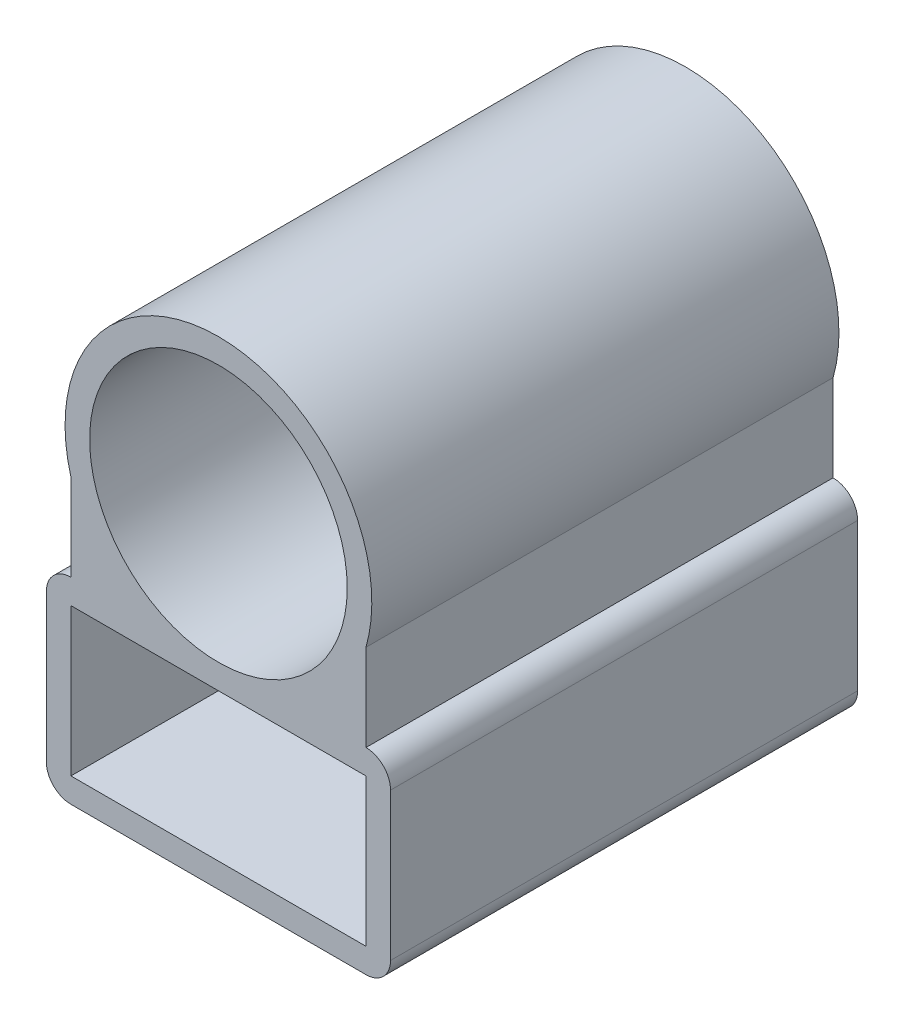
ISO-10303-21;
HEADER;
FILE_DESCRIPTION(('STEP AP214'),'2;1');
FILE_NAME('part.step','',(''),(''),'','','');
FILE_SCHEMA(('AUTOMOTIVE_DESIGN { 1 0 10303 214 1 1 1 1 }'));
ENDSEC;
DATA;
#1=APPLICATION_CONTEXT('core data for automotive mechanical design processes');
#2=APPLICATION_PROTOCOL_DEFINITION('international standard','automotive_design',2000,#1);
#3=PRODUCT_CONTEXT('',#1,'mechanical');
#4=PRODUCT('Part','Part','',(#3));
#5=PRODUCT_RELATED_PRODUCT_CATEGORY('part','',(#4));
#6=PRODUCT_DEFINITION_FORMATION('','',#4);
#7=PRODUCT_DEFINITION_CONTEXT('part definition',#1,'design');
#8=PRODUCT_DEFINITION('design','',#6,#7);
#9=PRODUCT_DEFINITION_SHAPE('','',#8);
#10=(LENGTH_UNIT() NAMED_UNIT(*) SI_UNIT(.MILLI.,.METRE.));
#11=(NAMED_UNIT(*) PLANE_ANGLE_UNIT() SI_UNIT($,.RADIAN.));
#12=(NAMED_UNIT(*) SI_UNIT($,.STERADIAN.) SOLID_ANGLE_UNIT());
#13=UNCERTAINTY_MEASURE_WITH_UNIT(LENGTH_MEASURE(1.E-05),#10,'distance_accuracy_value','');
#14=(GEOMETRIC_REPRESENTATION_CONTEXT(3) GLOBAL_UNCERTAINTY_ASSIGNED_CONTEXT((#13)) GLOBAL_UNIT_ASSIGNED_CONTEXT((#10,
#11,#12)) REPRESENTATION_CONTEXT('',''));
#15=CARTESIAN_POINT('',(0.,0.,0.));
#16=DIRECTION('',(0.,0.,1.));
#17=DIRECTION('',(1.,0.,0.));
#18=AXIS2_PLACEMENT_3D('',#15,#16,#17);
#19=CARTESIAN_POINT('',(60.,-62.3875,190.));
#20=DIRECTION('',(0.,0.,-1.));
#21=DIRECTION('',(-1.,0.,0.));
#22=AXIS2_PLACEMENT_3D('',#19,#20,#21);
#23=PLANE('',#22);
#24=CARTESIAN_POINT('',(0.,0.,190.));
#25=DIRECTION('',(0.,0.,1.));
#26=DIRECTION('',(1.,0.,0.));
#27=AXIS2_PLACEMENT_3D('',#24,#25,#26);
#28=CIRCLE('',#27,52.3875);
#29=CARTESIAN_POINT('',(52.3875,0.,190.));
#30=VERTEX_POINT('',#29);
#31=EDGE_CURVE('E176',#30,#30,#28,.T.);
#32=ORIENTED_EDGE('',*,*,#31,.F.);
#33=EDGE_LOOP('',(#32));
#34=FACE_BOUND('',#33,.T.);
#35=CARTESIAN_POINT('',(60.,-62.3875,190.));
#36=DIRECTION('',(0.,0.,1.));
#37=DIRECTION('',(-1.,0.,0.));
#38=AXIS2_PLACEMENT_3D('',#35,#36,#37);
#39=CIRCLE('',#38,9.99999999999999);
#40=CARTESIAN_POINT('',(70.,-62.3875,190.));
#41=VERTEX_POINT('',#40);
#42=CARTESIAN_POINT('',(60.,-52.3875,190.));
#43=VERTEX_POINT('',#42);
#44=EDGE_CURVE('E182',#41,#43,#39,.T.);
#45=ORIENTED_EDGE('',*,*,#44,.T.);
#46=DIRECTION('',(0.,1.,0.));
#47=VECTOR('',#46,1.);
#48=CARTESIAN_POINT('',(60.,-52.3875,190.));
#49=LINE('',#48,#47);
#50=CARTESIAN_POINT('',(60.,-17.0938631166275,190.));
#51=VERTEX_POINT('',#50);
#52=EDGE_CURVE('E185',#43,#51,#49,.T.);
#53=ORIENTED_EDGE('',*,*,#52,.T.);
#54=CARTESIAN_POINT('',(0.,0.,190.));
#55=DIRECTION('',(0.,0.,1.));
#56=DIRECTION('',(1.,0.,0.));
#57=AXIS2_PLACEMENT_3D('',#54,#55,#56);
#58=CIRCLE('',#57,62.3875);
#59=CARTESIAN_POINT('',(-60.,-17.0938631166276,190.));
#60=VERTEX_POINT('',#59);
#61=EDGE_CURVE('E188',#51,#60,#58,.T.);
#62=ORIENTED_EDGE('',*,*,#61,.T.);
#63=DIRECTION('',(0.,-1.,0.));
#64=VECTOR('',#63,1.);
#65=CARTESIAN_POINT('',(-60.,-52.3875,190.));
#66=LINE('',#65,#64);
#67=CARTESIAN_POINT('',(-60.,-52.3875,190.));
#68=VERTEX_POINT('',#67);
#69=EDGE_CURVE('E190',#60,#68,#66,.T.);
#70=ORIENTED_EDGE('',*,*,#69,.T.);
#71=CARTESIAN_POINT('',(-60.,-62.3875,190.));
#72=DIRECTION('',(0.,0.,1.));
#73=DIRECTION('',(1.,0.,0.));
#74=AXIS2_PLACEMENT_3D('',#71,#72,#73);
#75=CIRCLE('',#74,9.99999999999999);
#76=CARTESIAN_POINT('',(-70.,-62.3875,190.));
#77=VERTEX_POINT('',#76);
#78=EDGE_CURVE('E192',#68,#77,#75,.T.);
#79=ORIENTED_EDGE('',*,*,#78,.T.);
#80=DIRECTION('',(0.,-1.,0.));
#81=VECTOR('',#80,1.);
#82=CARTESIAN_POINT('',(-70.,-62.3875,190.));
#83=LINE('',#82,#81);
#84=CARTESIAN_POINT('',(-70.,-122.3875,190.));
#85=VERTEX_POINT('',#84);
#86=EDGE_CURVE('E194',#77,#85,#83,.T.);
#87=ORIENTED_EDGE('',*,*,#86,.T.);
#88=CARTESIAN_POINT('',(-60.,-122.3875,190.));
#89=DIRECTION('',(0.,0.,1.));
#90=DIRECTION('',(1.,0.,0.));
#91=AXIS2_PLACEMENT_3D('',#88,#89,#90);
#92=CIRCLE('',#91,10.);
#93=CARTESIAN_POINT('',(-60.,-132.3875,190.));
#94=VERTEX_POINT('',#93);
#95=EDGE_CURVE('E196',#85,#94,#92,.T.);
#96=ORIENTED_EDGE('',*,*,#95,.T.);
#97=DIRECTION('',(1.,0.,0.));
#98=VECTOR('',#97,1.);
#99=CARTESIAN_POINT('',(-60.,-132.3875,190.));
#100=LINE('',#99,#98);
#101=CARTESIAN_POINT('',(60.,-132.3875,190.));
#102=VERTEX_POINT('',#101);
#103=EDGE_CURVE('E198',#94,#102,#100,.T.);
#104=ORIENTED_EDGE('',*,*,#103,.T.);
#105=CARTESIAN_POINT('',(60.,-122.3875,190.));
#106=DIRECTION('',(0.,0.,1.));
#107=DIRECTION('',(1.,0.,0.));
#108=AXIS2_PLACEMENT_3D('',#105,#106,#107);
#109=CIRCLE('',#108,10.);
#110=CARTESIAN_POINT('',(70.,-122.3875,190.));
#111=VERTEX_POINT('',#110);
#112=EDGE_CURVE('E200',#102,#111,#109,.T.);
#113=ORIENTED_EDGE('',*,*,#112,.T.);
#114=DIRECTION('',(0.,1.,0.));
#115=VECTOR('',#114,1.);
#116=CARTESIAN_POINT('',(70.,-122.3875,190.));
#117=LINE('',#116,#115);
#118=EDGE_CURVE('E202',#111,#41,#117,.T.);
#119=ORIENTED_EDGE('',*,*,#118,.T.);
#120=EDGE_LOOP('',(#45,#53,#62,#70,#79,#87,#96,#104,#113,#119));
#121=FACE_BOUND('',#120,.T.);
#122=DIRECTION('',(-1.,0.,0.));
#123=VECTOR('',#122,1.);
#124=CARTESIAN_POINT('',(60.,-62.3875,190.));
#125=LINE('',#124,#123);
#126=CARTESIAN_POINT('',(60.,-62.3875,190.));
#127=VERTEX_POINT('',#126);
#128=CARTESIAN_POINT('',(-60.,-62.3875,190.));
#129=VERTEX_POINT('',#128);
#130=EDGE_CURVE('E140',#127,#129,#125,.T.);
#131=ORIENTED_EDGE('',*,*,#130,.F.);
#132=DIRECTION('',(0.,1.,0.));
#133=VECTOR('',#132,1.);
#134=CARTESIAN_POINT('',(60.,-122.3875,190.));
#135=LINE('',#134,#133);
#136=CARTESIAN_POINT('',(60.,-122.3875,190.));
#137=VERTEX_POINT('',#136);
#138=EDGE_CURVE('E162',#137,#127,#135,.T.);
#139=ORIENTED_EDGE('',*,*,#138,.F.);
#140=DIRECTION('',(1.,0.,0.));
#141=VECTOR('',#140,1.);
#142=CARTESIAN_POINT('',(-60.,-122.3875,190.));
#143=LINE('',#142,#141);
#144=CARTESIAN_POINT('',(-60.,-122.3875,190.));
#145=VERTEX_POINT('',#144);
#146=EDGE_CURVE('E160',#145,#137,#143,.T.);
#147=ORIENTED_EDGE('',*,*,#146,.F.);
#148=DIRECTION('',(0.,-1.,0.));
#149=VECTOR('',#148,1.);
#150=CARTESIAN_POINT('',(-60.,-62.3875,190.));
#151=LINE('',#150,#149);
#152=EDGE_CURVE('E148',#129,#145,#151,.T.);
#153=ORIENTED_EDGE('',*,*,#152,.F.);
#154=EDGE_LOOP('',(#131,#139,#147,#153));
#155=FACE_BOUND('',#154,.T.);
#156=ADVANCED_FACE('F39',(#34,#121,#155),#23,.F.);
#157=CARTESIAN_POINT('',(60.,-62.3875,0.));
#158=DIRECTION('',(0.,0.,-1.));
#159=DIRECTION('',(-1.,0.,0.));
#160=AXIS2_PLACEMENT_3D('',#157,#158,#159);
#161=PLANE('',#160);
#162=CARTESIAN_POINT('',(60.,-62.3875,0.));
#163=DIRECTION('',(0.,0.,1.));
#164=DIRECTION('',(-1.,0.,0.));
#165=AXIS2_PLACEMENT_3D('',#162,#163,#164);
#166=CIRCLE('',#165,9.99999999999999);
#167=CARTESIAN_POINT('',(70.,-62.3875,0.));
#168=VERTEX_POINT('',#167);
#169=CARTESIAN_POINT('',(60.,-52.3875,0.));
#170=VERTEX_POINT('',#169);
#171=EDGE_CURVE('E179',#168,#170,#166,.T.);
#172=ORIENTED_EDGE('',*,*,#171,.F.);
#173=DIRECTION('',(0.,1.,0.));
#174=VECTOR('',#173,1.);
#175=CARTESIAN_POINT('',(70.,-122.3875,0.));
#176=LINE('',#175,#174);
#177=CARTESIAN_POINT('',(70.,-122.3875,0.));
#178=VERTEX_POINT('',#177);
#179=EDGE_CURVE('E186',#178,#168,#176,.T.);
#180=ORIENTED_EDGE('',*,*,#179,.F.);
#181=CARTESIAN_POINT('',(60.,-122.3875,0.));
#182=DIRECTION('',(0.,0.,1.));
#183=DIRECTION('',(1.,0.,0.));
#184=AXIS2_PLACEMENT_3D('',#181,#182,#183);
#185=CIRCLE('',#184,10.);
#186=CARTESIAN_POINT('',(60.,-132.3875,0.));
#187=VERTEX_POINT('',#186);
#188=EDGE_CURVE('E221',#187,#178,#185,.T.);
#189=ORIENTED_EDGE('',*,*,#188,.F.);
#190=DIRECTION('',(1.,0.,0.));
#191=VECTOR('',#190,1.);
#192=CARTESIAN_POINT('',(-60.,-132.3875,0.));
#193=LINE('',#192,#191);
#194=CARTESIAN_POINT('',(-60.,-132.3875,0.));
#195=VERTEX_POINT('',#194);
#196=EDGE_CURVE('E219',#195,#187,#193,.T.);
#197=ORIENTED_EDGE('',*,*,#196,.F.);
#198=CARTESIAN_POINT('',(-60.,-122.3875,0.));
#199=DIRECTION('',(0.,0.,1.));
#200=DIRECTION('',(1.,0.,0.));
#201=AXIS2_PLACEMENT_3D('',#198,#199,#200);
#202=CIRCLE('',#201,10.);
#203=CARTESIAN_POINT('',(-70.,-122.3875,0.));
#204=VERTEX_POINT('',#203);
#205=EDGE_CURVE('E217',#204,#195,#202,.T.);
#206=ORIENTED_EDGE('',*,*,#205,.F.);
#207=DIRECTION('',(0.,-1.,0.));
#208=VECTOR('',#207,1.);
#209=CARTESIAN_POINT('',(-70.,-62.3875,0.));
#210=LINE('',#209,#208);
#211=CARTESIAN_POINT('',(-70.,-62.3875,0.));
#212=VERTEX_POINT('',#211);
#213=EDGE_CURVE('E215',#212,#204,#210,.T.);
#214=ORIENTED_EDGE('',*,*,#213,.F.);
#215=CARTESIAN_POINT('',(-60.,-62.3875,0.));
#216=DIRECTION('',(0.,0.,1.));
#217=DIRECTION('',(1.,0.,0.));
#218=AXIS2_PLACEMENT_3D('',#215,#216,#217);
#219=CIRCLE('',#218,9.99999999999999);
#220=CARTESIAN_POINT('',(-60.,-52.3875,0.));
#221=VERTEX_POINT('',#220);
#222=EDGE_CURVE('E213',#221,#212,#219,.T.);
#223=ORIENTED_EDGE('',*,*,#222,.F.);
#224=DIRECTION('',(0.,-1.,0.));
#225=VECTOR('',#224,1.);
#226=CARTESIAN_POINT('',(-60.,-52.3875,0.));
#227=LINE('',#226,#225);
#228=CARTESIAN_POINT('',(-60.,-17.0938631166276,0.));
#229=VERTEX_POINT('',#228);
#230=EDGE_CURVE('E211',#229,#221,#227,.T.);
#231=ORIENTED_EDGE('',*,*,#230,.F.);
#232=CARTESIAN_POINT('',(0.,0.,0.));
#233=DIRECTION('',(0.,0.,1.));
#234=DIRECTION('',(1.,0.,0.));
#235=AXIS2_PLACEMENT_3D('',#232,#233,#234);
#236=CIRCLE('',#235,62.3875);
#237=CARTESIAN_POINT('',(60.,-17.0938631166275,0.));
#238=VERTEX_POINT('',#237);
#239=EDGE_CURVE('E209',#238,#229,#236,.T.);
#240=ORIENTED_EDGE('',*,*,#239,.F.);
#241=DIRECTION('',(0.,1.,0.));
#242=VECTOR('',#241,1.);
#243=CARTESIAN_POINT('',(60.,-52.3875,0.));
#244=LINE('',#243,#242);
#245=EDGE_CURVE('E207',#170,#238,#244,.T.);
#246=ORIENTED_EDGE('',*,*,#245,.F.);
#247=EDGE_LOOP('',(#172,#180,#189,#197,#206,#214,#223,#231,#240,#246));
#248=FACE_BOUND('',#247,.T.);
#249=CARTESIAN_POINT('',(0.,0.,0.));
#250=DIRECTION('',(0.,0.,1.));
#251=DIRECTION('',(1.,0.,0.));
#252=AXIS2_PLACEMENT_3D('',#249,#250,#251);
#253=CIRCLE('',#252,52.3875);
#254=CARTESIAN_POINT('',(52.3875,0.,0.));
#255=VERTEX_POINT('',#254);
#256=EDGE_CURVE('E156',#255,#255,#253,.T.);
#257=ORIENTED_EDGE('',*,*,#256,.T.);
#258=EDGE_LOOP('',(#257));
#259=FACE_BOUND('',#258,.T.);
#260=DIRECTION('',(0.,1.,0.));
#261=VECTOR('',#260,1.);
#262=CARTESIAN_POINT('',(60.,-122.3875,0.));
#263=LINE('',#262,#261);
#264=CARTESIAN_POINT('',(60.,-122.3875,0.));
#265=VERTEX_POINT('',#264);
#266=CARTESIAN_POINT('',(60.,-62.3875,0.));
#267=VERTEX_POINT('',#266);
#268=EDGE_CURVE('E149',#265,#267,#263,.T.);
#269=ORIENTED_EDGE('',*,*,#268,.T.);
#270=DIRECTION('',(-1.,0.,0.));
#271=VECTOR('',#270,1.);
#272=CARTESIAN_POINT('',(60.,-62.3875,0.));
#273=LINE('',#272,#271);
#274=CARTESIAN_POINT('',(-60.,-62.3875,0.));
#275=VERTEX_POINT('',#274);
#276=EDGE_CURVE('E62',#267,#275,#273,.T.);
#277=ORIENTED_EDGE('',*,*,#276,.T.);
#278=DIRECTION('',(0.,-1.,0.));
#279=VECTOR('',#278,1.);
#280=CARTESIAN_POINT('',(-60.,-62.3875,0.));
#281=LINE('',#280,#279);
#282=CARTESIAN_POINT('',(-60.,-122.3875,0.));
#283=VERTEX_POINT('',#282);
#284=EDGE_CURVE('E155',#275,#283,#281,.T.);
#285=ORIENTED_EDGE('',*,*,#284,.T.);
#286=DIRECTION('',(1.,0.,0.));
#287=VECTOR('',#286,1.);
#288=CARTESIAN_POINT('',(-60.,-122.3875,0.));
#289=LINE('',#288,#287);
#290=EDGE_CURVE('E168',#283,#265,#289,.T.);
#291=ORIENTED_EDGE('',*,*,#290,.T.);
#292=EDGE_LOOP('',(#269,#277,#285,#291));
#293=FACE_BOUND('',#292,.T.);
#294=ADVANCED_FACE('F257',(#248,#259,#293),#161,.T.);
#295=CARTESIAN_POINT('',(60.,-62.3875,190.));
#296=DIRECTION('',(0.,0.,-1.));
#297=DIRECTION('',(-1.,0.,0.));
#298=AXIS2_PLACEMENT_3D('',#295,#296,#297);
#299=CYLINDRICAL_SURFACE('',#298,9.99999999999999);
#300=ORIENTED_EDGE('',*,*,#171,.T.);
#301=DIRECTION('',(0.,0.,-1.));
#302=VECTOR('',#301,1.);
#303=CARTESIAN_POINT('',(60.,-52.3875,190.));
#304=LINE('',#303,#302);
#305=EDGE_CURVE('E11',#43,#170,#304,.T.);
#306=ORIENTED_EDGE('',*,*,#305,.F.);
#307=ORIENTED_EDGE('',*,*,#44,.F.);
#308=DIRECTION('',(0.,0.,-1.));
#309=VECTOR('',#308,1.);
#310=CARTESIAN_POINT('',(70.,-62.3875,190.));
#311=LINE('',#310,#309);
#312=EDGE_CURVE('E204',#41,#168,#311,.T.);
#313=ORIENTED_EDGE('',*,*,#312,.T.);
#314=EDGE_LOOP('',(#300,#306,#307,#313));
#315=FACE_BOUND('',#314,.T.);
#316=ADVANCED_FACE('F41',(#315),#299,.T.);
#317=CARTESIAN_POINT('',(60.,-52.3875,190.));
#318=DIRECTION('',(-1.,0.,0.));
#319=DIRECTION('',(0.,0.,1.));
#320=AXIS2_PLACEMENT_3D('',#317,#318,#319);
#321=PLANE('',#320);
#322=ORIENTED_EDGE('',*,*,#245,.T.);
#323=DIRECTION('',(0.,0.,-1.));
#324=VECTOR('',#323,1.);
#325=CARTESIAN_POINT('',(60.,-17.0938631166275,190.));
#326=LINE('',#325,#324);
#327=EDGE_CURVE('E47',#51,#238,#326,.T.);
#328=ORIENTED_EDGE('',*,*,#327,.F.);
#329=ORIENTED_EDGE('',*,*,#52,.F.);
#330=ORIENTED_EDGE('',*,*,#305,.T.);
#331=EDGE_LOOP('',(#322,#328,#329,#330));
#332=FACE_BOUND('',#331,.T.);
#333=ADVANCED_FACE('F274',(#332),#321,.F.);
#334=CARTESIAN_POINT('',(0.,0.,190.));
#335=DIRECTION('',(0.,0.,-1.));
#336=DIRECTION('',(-1.,0.,0.));
#337=AXIS2_PLACEMENT_3D('',#334,#335,#336);
#338=CYLINDRICAL_SURFACE('',#337,62.3875);
#339=ORIENTED_EDGE('',*,*,#239,.T.);
#340=DIRECTION('',(0.,0.,-1.));
#341=VECTOR('',#340,1.);
#342=CARTESIAN_POINT('',(-60.,-17.0938631166276,190.));
#343=LINE('',#342,#341);
#344=EDGE_CURVE('E244',#60,#229,#343,.T.);
#345=ORIENTED_EDGE('',*,*,#344,.F.);
#346=ORIENTED_EDGE('',*,*,#61,.F.);
#347=ORIENTED_EDGE('',*,*,#327,.T.);
#348=EDGE_LOOP('',(#339,#345,#346,#347));
#349=FACE_BOUND('',#348,.T.);
#350=ADVANCED_FACE('F251',(#349),#338,.T.);
#351=CARTESIAN_POINT('',(-60.,-52.3875,190.));
#352=DIRECTION('',(1.,0.,0.));
#353=DIRECTION('',(0.,0.,-1.));
#354=AXIS2_PLACEMENT_3D('',#351,#352,#353);
#355=PLANE('',#354);
#356=ORIENTED_EDGE('',*,*,#230,.T.);
#357=DIRECTION('',(0.,0.,-1.));
#358=VECTOR('',#357,1.);
#359=CARTESIAN_POINT('',(-60.,-52.3875,190.));
#360=LINE('',#359,#358);
#361=EDGE_CURVE('E241',#68,#221,#360,.T.);
#362=ORIENTED_EDGE('',*,*,#361,.F.);
#363=ORIENTED_EDGE('',*,*,#69,.F.);
#364=ORIENTED_EDGE('',*,*,#344,.T.);
#365=EDGE_LOOP('',(#356,#362,#363,#364));
#366=FACE_BOUND('',#365,.T.);
#367=ADVANCED_FACE('F263',(#366),#355,.F.);
#368=CARTESIAN_POINT('',(-60.,-62.3875,190.));
#369=DIRECTION('',(0.,0.,-1.));
#370=DIRECTION('',(-1.,0.,0.));
#371=AXIS2_PLACEMENT_3D('',#368,#369,#370);
#372=CYLINDRICAL_SURFACE('',#371,9.99999999999999);
#373=ORIENTED_EDGE('',*,*,#222,.T.);
#374=DIRECTION('',(0.,0.,-1.));
#375=VECTOR('',#374,1.);
#376=CARTESIAN_POINT('',(-70.,-62.3875,190.));
#377=LINE('',#376,#375);
#378=EDGE_CURVE('E238',#77,#212,#377,.T.);
#379=ORIENTED_EDGE('',*,*,#378,.F.);
#380=ORIENTED_EDGE('',*,*,#78,.F.);
#381=ORIENTED_EDGE('',*,*,#361,.T.);
#382=EDGE_LOOP('',(#373,#379,#380,#381));
#383=FACE_BOUND('',#382,.T.);
#384=ADVANCED_FACE('F267',(#383),#372,.T.);
#385=CARTESIAN_POINT('',(-70.,-62.3875,190.));
#386=DIRECTION('',(1.,0.,0.));
#387=DIRECTION('',(0.,1.,0.));
#388=AXIS2_PLACEMENT_3D('',#385,#386,#387);
#389=PLANE('',#388);
#390=ORIENTED_EDGE('',*,*,#213,.T.);
#391=DIRECTION('',(0.,0.,-1.));
#392=VECTOR('',#391,1.);
#393=CARTESIAN_POINT('',(-70.,-122.3875,190.));
#394=LINE('',#393,#392);
#395=EDGE_CURVE('E235',#85,#204,#394,.T.);
#396=ORIENTED_EDGE('',*,*,#395,.F.);
#397=ORIENTED_EDGE('',*,*,#86,.F.);
#398=ORIENTED_EDGE('',*,*,#378,.T.);
#399=EDGE_LOOP('',(#390,#396,#397,#398));
#400=FACE_BOUND('',#399,.T.);
#401=ADVANCED_FACE('F297',(#400),#389,.F.);
#402=CARTESIAN_POINT('',(-60.,-122.3875,190.));
#403=DIRECTION('',(0.,0.,-1.));
#404=DIRECTION('',(-1.,0.,0.));
#405=AXIS2_PLACEMENT_3D('',#402,#403,#404);
#406=CYLINDRICAL_SURFACE('',#405,10.);
#407=ORIENTED_EDGE('',*,*,#205,.T.);
#408=DIRECTION('',(0.,0.,-1.));
#409=VECTOR('',#408,1.);
#410=CARTESIAN_POINT('',(-60.,-132.3875,190.));
#411=LINE('',#410,#409);
#412=EDGE_CURVE('E232',#94,#195,#411,.T.);
#413=ORIENTED_EDGE('',*,*,#412,.F.);
#414=ORIENTED_EDGE('',*,*,#95,.F.);
#415=ORIENTED_EDGE('',*,*,#395,.T.);
#416=EDGE_LOOP('',(#407,#413,#414,#415));
#417=FACE_BOUND('',#416,.T.);
#418=ADVANCED_FACE('F294',(#417),#406,.T.);
#419=CARTESIAN_POINT('',(-60.,-132.3875,190.));
#420=DIRECTION('',(0.,1.,0.));
#421=DIRECTION('',(0.,0.,1.));
#422=AXIS2_PLACEMENT_3D('',#419,#420,#421);
#423=PLANE('',#422);
#424=ORIENTED_EDGE('',*,*,#196,.T.);
#425=DIRECTION('',(0.,0.,-1.));
#426=VECTOR('',#425,1.);
#427=CARTESIAN_POINT('',(60.,-132.3875,190.));
#428=LINE('',#427,#426);
#429=EDGE_CURVE('E229',#102,#187,#428,.T.);
#430=ORIENTED_EDGE('',*,*,#429,.F.);
#431=ORIENTED_EDGE('',*,*,#103,.F.);
#432=ORIENTED_EDGE('',*,*,#412,.T.);
#433=EDGE_LOOP('',(#424,#430,#431,#432));
#434=FACE_BOUND('',#433,.T.);
#435=ADVANCED_FACE('F290',(#434),#423,.F.);
#436=CARTESIAN_POINT('',(60.,-122.3875,190.));
#437=DIRECTION('',(0.,0.,-1.));
#438=DIRECTION('',(-1.,0.,0.));
#439=AXIS2_PLACEMENT_3D('',#436,#437,#438);
#440=CYLINDRICAL_SURFACE('',#439,10.);
#441=ORIENTED_EDGE('',*,*,#188,.T.);
#442=DIRECTION('',(0.,0.,-1.));
#443=VECTOR('',#442,1.);
#444=CARTESIAN_POINT('',(70.,-122.3875,190.));
#445=LINE('',#444,#443);
#446=EDGE_CURVE('E226',#111,#178,#445,.T.);
#447=ORIENTED_EDGE('',*,*,#446,.F.);
#448=ORIENTED_EDGE('',*,*,#112,.F.);
#449=ORIENTED_EDGE('',*,*,#429,.T.);
#450=EDGE_LOOP('',(#441,#447,#448,#449));
#451=FACE_BOUND('',#450,.T.);
#452=ADVANCED_FACE('F286',(#451),#440,.T.);
#453=CARTESIAN_POINT('',(70.,-122.3875,190.));
#454=DIRECTION('',(-1.,0.,0.));
#455=DIRECTION('',(0.,-1.,0.));
#456=AXIS2_PLACEMENT_3D('',#453,#454,#455);
#457=PLANE('',#456);
#458=ORIENTED_EDGE('',*,*,#179,.T.);
#459=ORIENTED_EDGE('',*,*,#312,.F.);
#460=ORIENTED_EDGE('',*,*,#118,.F.);
#461=ORIENTED_EDGE('',*,*,#446,.T.);
#462=EDGE_LOOP('',(#458,#459,#460,#461));
#463=FACE_BOUND('',#462,.T.);
#464=ADVANCED_FACE('F281',(#463),#457,.F.);
#465=CARTESIAN_POINT('',(0.,0.,190.));
#466=DIRECTION('',(0.,0.,-1.));
#467=DIRECTION('',(-1.,0.,0.));
#468=AXIS2_PLACEMENT_3D('',#465,#466,#467);
#469=CYLINDRICAL_SURFACE('',#468,52.3875);
#470=ORIENTED_EDGE('',*,*,#31,.T.);
#471=EDGE_LOOP('',(#470));
#472=FACE_BOUND('',#471,.T.);
#473=ORIENTED_EDGE('',*,*,#256,.F.);
#474=EDGE_LOOP('',(#473));
#475=FACE_BOUND('',#474,.T.);
#476=ADVANCED_FACE('F315',(#472,#475),#469,.F.);
#477=CARTESIAN_POINT('',(60.,-62.3875,190.));
#478=DIRECTION('',(0.,-1.,0.));
#479=DIRECTION('',(0.,0.,-1.));
#480=AXIS2_PLACEMENT_3D('',#477,#478,#479);
#481=PLANE('',#480);
#482=ORIENTED_EDGE('',*,*,#276,.F.);
#483=DIRECTION('',(0.,0.,-1.));
#484=VECTOR('',#483,1.);
#485=CARTESIAN_POINT('',(60.,-62.3875,190.));
#486=LINE('',#485,#484);
#487=EDGE_CURVE('E144',#127,#267,#486,.T.);
#488=ORIENTED_EDGE('',*,*,#487,.F.);
#489=ORIENTED_EDGE('',*,*,#130,.T.);
#490=DIRECTION('',(0.,0.,-1.));
#491=VECTOR('',#490,1.);
#492=CARTESIAN_POINT('',(-60.,-62.3875,190.));
#493=LINE('',#492,#491);
#494=EDGE_CURVE('E143',#129,#275,#493,.T.);
#495=ORIENTED_EDGE('',*,*,#494,.T.);
#496=EDGE_LOOP('',(#482,#488,#489,#495));
#497=FACE_BOUND('',#496,.T.);
#498=ADVANCED_FACE('F142',(#497),#481,.T.);
#499=CARTESIAN_POINT('',(-60.,-62.3875,190.));
#500=DIRECTION('',(1.,0.,0.));
#501=DIRECTION('',(0.,1.,0.));
#502=AXIS2_PLACEMENT_3D('',#499,#500,#501);
#503=PLANE('',#502);
#504=ORIENTED_EDGE('',*,*,#284,.F.);
#505=ORIENTED_EDGE('',*,*,#494,.F.);
#506=ORIENTED_EDGE('',*,*,#152,.T.);
#507=DIRECTION('',(0.,0.,-1.));
#508=VECTOR('',#507,1.);
#509=CARTESIAN_POINT('',(-60.,-122.3875,190.));
#510=LINE('',#509,#508);
#511=EDGE_CURVE('E157',#145,#283,#510,.T.);
#512=ORIENTED_EDGE('',*,*,#511,.T.);
#513=EDGE_LOOP('',(#504,#505,#506,#512));
#514=FACE_BOUND('',#513,.T.);
#515=ADVANCED_FACE('F152',(#514),#503,.T.);
#516=CARTESIAN_POINT('',(-60.,-122.3875,190.));
#517=DIRECTION('',(0.,1.,0.));
#518=DIRECTION('',(0.,0.,1.));
#519=AXIS2_PLACEMENT_3D('',#516,#517,#518);
#520=PLANE('',#519);
#521=ORIENTED_EDGE('',*,*,#290,.F.);
#522=ORIENTED_EDGE('',*,*,#511,.F.);
#523=ORIENTED_EDGE('',*,*,#146,.T.);
#524=DIRECTION('',(0.,0.,-1.));
#525=VECTOR('',#524,1.);
#526=CARTESIAN_POINT('',(60.,-122.3875,190.));
#527=LINE('',#526,#525);
#528=EDGE_CURVE('E54',#137,#265,#527,.T.);
#529=ORIENTED_EDGE('',*,*,#528,.T.);
#530=EDGE_LOOP('',(#521,#522,#523,#529));
#531=FACE_BOUND('',#530,.T.);
#532=ADVANCED_FACE('F357',(#531),#520,.T.);
#533=CARTESIAN_POINT('',(60.,-122.3875,190.));
#534=DIRECTION('',(-1.,0.,0.));
#535=DIRECTION('',(0.,-1.,0.));
#536=AXIS2_PLACEMENT_3D('',#533,#534,#535);
#537=PLANE('',#536);
#538=ORIENTED_EDGE('',*,*,#268,.F.);
#539=ORIENTED_EDGE('',*,*,#528,.F.);
#540=ORIENTED_EDGE('',*,*,#138,.T.);
#541=ORIENTED_EDGE('',*,*,#487,.T.);
#542=EDGE_LOOP('',(#538,#539,#540,#541));
#543=FACE_BOUND('',#542,.T.);
#544=ADVANCED_FACE('F365',(#543),#537,.T.);
#545=CLOSED_SHELL('',(#156,#294,#316,#333,#350,#367,#384,#401,#418,#435,#452,#464,#476,#498,
#515,#532,#544));
#546=MANIFOLD_SOLID_BREP('B2',#545);
#547=ADVANCED_BREP_SHAPE_REPRESENTATION('',(#18,#546),#14);
#548=SHAPE_DEFINITION_REPRESENTATION(#9,#547);
ENDSEC;
END-ISO-10303-21;
